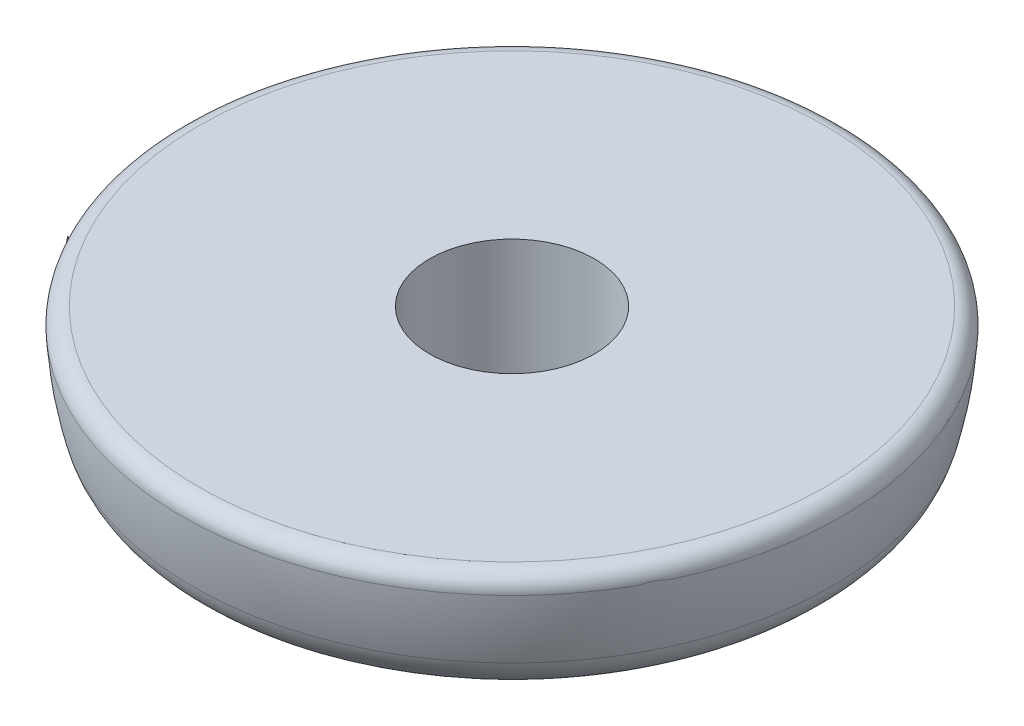
ISO-10303-21;
HEADER;
FILE_DESCRIPTION(('STEP AP214'),'2;1');
FILE_NAME('part.step','',(''),(''),'','','');
FILE_SCHEMA(('AUTOMOTIVE_DESIGN { 1 0 10303 214 1 1 1 1 }'));
ENDSEC;
DATA;
#1=APPLICATION_CONTEXT('core data for automotive mechanical design processes');
#2=APPLICATION_PROTOCOL_DEFINITION('international standard','automotive_design',2000,#1);
#3=PRODUCT_CONTEXT('',#1,'mechanical');
#4=PRODUCT('Part','Part','',(#3));
#5=PRODUCT_RELATED_PRODUCT_CATEGORY('part','',(#4));
#6=PRODUCT_DEFINITION_FORMATION('','',#4);
#7=PRODUCT_DEFINITION_CONTEXT('part definition',#1,'design');
#8=PRODUCT_DEFINITION('design','',#6,#7);
#9=PRODUCT_DEFINITION_SHAPE('','',#8);
#10=(LENGTH_UNIT() NAMED_UNIT(*) SI_UNIT(.MILLI.,.METRE.));
#11=(NAMED_UNIT(*) PLANE_ANGLE_UNIT() SI_UNIT($,.RADIAN.));
#12=(NAMED_UNIT(*) SI_UNIT($,.STERADIAN.) SOLID_ANGLE_UNIT());
#13=UNCERTAINTY_MEASURE_WITH_UNIT(LENGTH_MEASURE(1.E-05),#10,'distance_accuracy_value','');
#14=(GEOMETRIC_REPRESENTATION_CONTEXT(3) GLOBAL_UNCERTAINTY_ASSIGNED_CONTEXT((#13)) GLOBAL_UNIT_ASSIGNED_CONTEXT((#10,
#11,#12)) REPRESENTATION_CONTEXT('',''));
#15=CARTESIAN_POINT('',(0.,0.,0.));
#16=DIRECTION('',(0.,0.,1.));
#17=DIRECTION('',(1.,0.,0.));
#18=AXIS2_PLACEMENT_3D('',#15,#16,#17);
#19=CARTESIAN_POINT('',(0.,-4.276906118832,0.));
#20=DIRECTION('',(0.,-1.,0.));
#21=DIRECTION('',(-1.,0.,0.));
#22=AXIS2_PLACEMENT_3D('',#19,#20,#21);
#23=TOROIDAL_SURFACE('',#22,16.45320862478,3.);
#24=CARTESIAN_POINT('',(0.,-5.03165425744752,0.));
#25=DIRECTION('',(0.,-1.,0.));
#26=DIRECTION('',(-1.,0.,0.));
#27=AXIS2_PLACEMENT_3D('',#24,#25,#26);
#28=CIRCLE('',#27,19.3567160291543);
#29=CARTESIAN_POINT('',(-19.3567160291543,-5.03165425744752,0.));
#30=VERTEX_POINT('',#29);
#31=EDGE_CURVE('E77',#30,#30,#28,.F.);
#32=ORIENTED_EDGE('',*,*,#31,.F.);
#33=EDGE_LOOP('',(#32));
#34=FACE_BOUND('',#33,.T.);
#35=CARTESIAN_POINT('',(0.,-7.20001631318555,0.));
#36=DIRECTION('',(0.,1.,0.));
#37=DIRECTION('',(1.,0.,0.));
#38=AXIS2_PLACEMENT_3D('',#35,#36,#37);
#39=CIRCLE('',#38,17.1280617878194);
#40=CARTESIAN_POINT('',(17.1280617878194,-7.20001631318555,0.));
#41=VERTEX_POINT('',#40);
#42=EDGE_CURVE('E80',#41,#41,#39,.F.);
#43=ORIENTED_EDGE('',*,*,#42,.F.);
#44=EDGE_LOOP('',(#43));
#45=FACE_BOUND('',#44,.T.);
#46=ADVANCED_FACE('F16',(#34,#45),#23,.T.);
#47=CARTESIAN_POINT('',(0.,-7.20001631318555,0.));
#48=DIRECTION('',(0.,1.,0.));
#49=DIRECTION('',(0.,0.,1.));
#50=AXIS2_PLACEMENT_3D('',#47,#48,#49);
#51=CONICAL_SURFACE('',#50,17.1280617878194,1.34390352403538);
#52=ORIENTED_EDGE('',*,*,#42,.T.);
#53=EDGE_LOOP('',(#52));
#54=FACE_BOUND('',#53,.T.);
#55=CARTESIAN_POINT('',(0.,-9.7171977658662,0.));
#56=DIRECTION('',(0.,-1.,0.));
#57=DIRECTION('',(0.99997053715269,0.,0.00767625081400493));
#58=AXIS2_PLACEMENT_3D('',#55,#56,#57);
#59=CIRCLE('',#58,6.22495105434404);
#60=CARTESIAN_POINT('',(6.22476764956162,-9.7171977658662,0.0477842855980493));
#61=VERTEX_POINT('',#60);
#62=EDGE_CURVE('E74',#61,#61,#59,.T.);
#63=ORIENTED_EDGE('',*,*,#62,.F.);
#64=EDGE_LOOP('',(#63));
#65=FACE_BOUND('',#64,.T.);
#66=ADVANCED_FACE('F92',(#54,#65),#51,.T.);
#67=CARTESIAN_POINT('',(0.,0.,0.));
#68=DIRECTION('',(-1.,0.,0.));
#69=DIRECTION('',(0.,0.,-1.));
#70=AXIS2_PLACEMENT_3D('',#67,#68,#69);
#71=SPHERICAL_SURFACE('',#70,20.);
#72=ORIENTED_EDGE('',*,*,#31,.T.);
#73=EDGE_LOOP('',(#72));
#74=FACE_BOUND('',#73,.T.);
#75=CARTESIAN_POINT('',(0.,-1.05263157894689,0.));
#76=DIRECTION('',(0.,-1.,0.));
#77=DIRECTION('',(0.999979997820092,0.,0.00632486835670095));
#78=AXIS2_PLACEMENT_3D('',#75,#76,#77);
#79=CIRCLE('',#78,19.9722799589579);
#80=CARTESIAN_POINT('',(19.971880469821,-1.05263157894689,0.126322041523585));
#81=VERTEX_POINT('',#80);
#82=EDGE_CURVE('E76',#81,#81,#79,.F.);
#83=ORIENTED_EDGE('',*,*,#82,.F.);
#84=EDGE_LOOP('',(#83));
#85=FACE_BOUND('',#84,.T.);
#86=ADVANCED_FACE('F68',(#74,#85),#71,.T.);
#87=CARTESIAN_POINT('',(0.,-8.742827701081,0.));
#88=DIRECTION('',(0.,-1.,0.));
#89=DIRECTION('',(0.99997053715269,0.,0.00767625081400493));
#90=AXIS2_PLACEMENT_3D('',#87,#88,#89);
#91=TOROIDAL_SURFACE('',#90,6.,1.);
#92=CARTESIAN_POINT('',(0.,-8.742827701081,0.));
#93=DIRECTION('',(0.,-1.,0.));
#94=DIRECTION('',(0.,0.,-1.));
#95=AXIS2_PLACEMENT_3D('',#92,#93,#94);
#96=CIRCLE('',#95,5.);
#97=CARTESIAN_POINT('',(0.,-8.742827701081,-5.));
#98=VERTEX_POINT('',#97);
#99=EDGE_CURVE('E40',#98,#98,#96,.F.);
#100=ORIENTED_EDGE('',*,*,#99,.T.);
#101=EDGE_LOOP('',(#100));
#102=FACE_BOUND('',#101,.T.);
#103=ORIENTED_EDGE('',*,*,#62,.T.);
#104=EDGE_LOOP('',(#103));
#105=FACE_BOUND('',#104,.T.);
#106=ADVANCED_FACE('F62',(#102,#105),#91,.T.);
#107=CARTESIAN_POINT('',(0.,-1.,0.));
#108=DIRECTION('',(0.,-1.,0.));
#109=DIRECTION('',(0.999979997820092,0.,0.00632486835670095));
#110=AXIS2_PLACEMENT_3D('',#107,#108,#109);
#111=TOROIDAL_SURFACE('',#110,18.97366596101,1.);
#112=ORIENTED_EDGE('',*,*,#82,.T.);
#113=EDGE_LOOP('',(#112));
#114=FACE_BOUND('',#113,.T.);
#115=CARTESIAN_POINT('',(0.,0.,0.));
#116=DIRECTION('',(0.,-1.,0.));
#117=DIRECTION('',(-1.,0.,0.));
#118=AXIS2_PLACEMENT_3D('',#115,#116,#117);
#119=CIRCLE('',#118,18.97366596101);
#120=CARTESIAN_POINT('',(-18.97366596101,0.,0.));
#121=VERTEX_POINT('',#120);
#122=CARTESIAN_POINT('',(18.97366596101,0.,0.));
#123=VERTEX_POINT('',#122);
#124=EDGE_CURVE('E28',#121,#123,#119,.T.);
#125=ORIENTED_EDGE('',*,*,#124,.T.);
#126=CARTESIAN_POINT('',(0.,0.,0.));
#127=DIRECTION('',(0.,-1.,0.));
#128=DIRECTION('',(1.,0.,0.));
#129=AXIS2_PLACEMENT_3D('',#126,#127,#128);
#130=CIRCLE('',#129,18.97366596101);
#131=EDGE_CURVE('E36',#123,#121,#130,.T.);
#132=ORIENTED_EDGE('',*,*,#131,.T.);
#133=EDGE_LOOP('',(#125,#132));
#134=FACE_BOUND('',#133,.T.);
#135=ADVANCED_FACE('F43',(#114,#134),#111,.T.);
#136=CARTESIAN_POINT('',(0.,0.5,0.));
#137=DIRECTION('',(0.,-1.,0.));
#138=DIRECTION('',(0.,0.,-1.));
#139=AXIS2_PLACEMENT_3D('',#136,#137,#138);
#140=CYLINDRICAL_SURFACE('',#139,5.);
#141=CARTESIAN_POINT('',(0.,0.,0.));
#142=DIRECTION('',(0.,-1.,0.));
#143=DIRECTION('',(0.,0.,-1.));
#144=AXIS2_PLACEMENT_3D('',#141,#142,#143);
#145=CIRCLE('',#144,5.);
#146=CARTESIAN_POINT('',(0.,0.,-5.));
#147=VERTEX_POINT('',#146);
#148=EDGE_CURVE('E11',#147,#147,#145,.F.);
#149=ORIENTED_EDGE('',*,*,#148,.T.);
#150=EDGE_LOOP('',(#149));
#151=FACE_BOUND('',#150,.T.);
#152=ORIENTED_EDGE('',*,*,#99,.F.);
#153=EDGE_LOOP('',(#152));
#154=FACE_BOUND('',#153,.T.);
#155=ADVANCED_FACE('F61',(#151,#154),#140,.F.);
#156=CARTESIAN_POINT('',(0.,0.,0.));
#157=DIRECTION('',(0.,-1.,0.));
#158=DIRECTION('',(0.,0.,-1.));
#159=AXIS2_PLACEMENT_3D('',#156,#157,#158);
#160=PLANE('',#159);
#161=ORIENTED_EDGE('',*,*,#148,.F.);
#162=EDGE_LOOP('',(#161));
#163=FACE_BOUND('',#162,.T.);
#164=ORIENTED_EDGE('',*,*,#131,.F.);
#165=ORIENTED_EDGE('',*,*,#124,.F.);
#166=EDGE_LOOP('',(#164,#165));
#167=FACE_BOUND('',#166,.T.);
#168=ADVANCED_FACE('F38',(#163,#167),#160,.F.);
#169=CLOSED_SHELL('',(#46,#66,#86,#106,#135,#155,#168));
#170=MANIFOLD_SOLID_BREP('B1',#169);
#171=ADVANCED_BREP_SHAPE_REPRESENTATION('',(#18,#170),#14);
#172=SHAPE_DEFINITION_REPRESENTATION(#9,#171);
ENDSEC;
END-ISO-10303-21;
